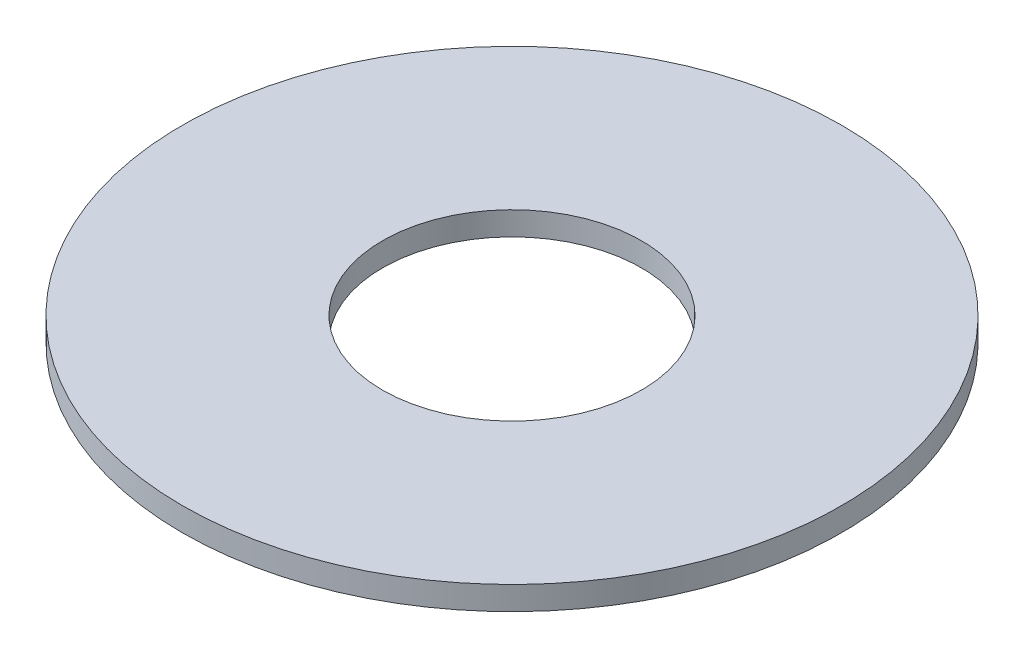
ISO-10303-21;
HEADER;
FILE_DESCRIPTION(('STEP AP214'),'2;1');
FILE_NAME('part.step','',(''),(''),'','','');
FILE_SCHEMA(('AUTOMOTIVE_DESIGN { 1 0 10303 214 1 1 1 1 }'));
ENDSEC;
DATA;
#1=APPLICATION_CONTEXT('core data for automotive mechanical design processes');
#2=APPLICATION_PROTOCOL_DEFINITION('international standard','automotive_design',2000,#1);
#3=PRODUCT_CONTEXT('',#1,'mechanical');
#4=PRODUCT('Part','Part','',(#3));
#5=PRODUCT_RELATED_PRODUCT_CATEGORY('part','',(#4));
#6=PRODUCT_DEFINITION_FORMATION('','',#4);
#7=PRODUCT_DEFINITION_CONTEXT('part definition',#1,'design');
#8=PRODUCT_DEFINITION('design','',#6,#7);
#9=PRODUCT_DEFINITION_SHAPE('','',#8);
#10=(LENGTH_UNIT() NAMED_UNIT(*) SI_UNIT(.MILLI.,.METRE.));
#11=(NAMED_UNIT(*) PLANE_ANGLE_UNIT() SI_UNIT($,.RADIAN.));
#12=(NAMED_UNIT(*) SI_UNIT($,.STERADIAN.) SOLID_ANGLE_UNIT());
#13=UNCERTAINTY_MEASURE_WITH_UNIT(LENGTH_MEASURE(1.E-05),#10,'distance_accuracy_value','');
#14=(GEOMETRIC_REPRESENTATION_CONTEXT(3) GLOBAL_UNCERTAINTY_ASSIGNED_CONTEXT((#13)) GLOBAL_UNIT_ASSIGNED_CONTEXT((#10,
#11,#12)) REPRESENTATION_CONTEXT('',''));
#15=CARTESIAN_POINT('',(0.,0.,0.));
#16=DIRECTION('',(0.,0.,1.));
#17=DIRECTION('',(1.,0.,0.));
#18=AXIS2_PLACEMENT_3D('',#15,#16,#17);
#19=CARTESIAN_POINT('',(0.,5.,0.));
#20=DIRECTION('',(0.,-1.,0.));
#21=DIRECTION('',(0.,0.,-1.));
#22=AXIS2_PLACEMENT_3D('',#19,#20,#21);
#23=CYLINDRICAL_SURFACE('',#22,70.);
#24=CARTESIAN_POINT('',(0.,5.,0.));
#25=DIRECTION('',(0.,1.,0.));
#26=DIRECTION('',(0.,0.,1.));
#27=AXIS2_PLACEMENT_3D('',#24,#25,#26);
#28=CIRCLE('',#27,70.);
#29=CARTESIAN_POINT('',(0.,5.,70.));
#30=VERTEX_POINT('',#29);
#31=EDGE_CURVE('E10',#30,#30,#28,.T.);
#32=ORIENTED_EDGE('',*,*,#31,.F.);
#33=EDGE_LOOP('',(#32));
#34=FACE_BOUND('',#33,.T.);
#35=CARTESIAN_POINT('',(0.,0.,0.));
#36=DIRECTION('',(0.,1.,0.));
#37=DIRECTION('',(0.,0.,1.));
#38=AXIS2_PLACEMENT_3D('',#35,#36,#37);
#39=CIRCLE('',#38,70.);
#40=CARTESIAN_POINT('',(0.,0.,70.));
#41=VERTEX_POINT('',#40);
#42=EDGE_CURVE('E37',#41,#41,#39,.T.);
#43=ORIENTED_EDGE('',*,*,#42,.T.);
#44=EDGE_LOOP('',(#43));
#45=FACE_BOUND('',#44,.T.);
#46=ADVANCED_FACE('F40',(#34,#45),#23,.T.);
#47=CARTESIAN_POINT('',(0.,5.,0.));
#48=DIRECTION('',(0.,1.,0.));
#49=DIRECTION('',(0.,0.,1.));
#50=AXIS2_PLACEMENT_3D('',#47,#48,#49);
#51=PLANE('',#50);
#52=CARTESIAN_POINT('',(0.,5.,0.));
#53=DIRECTION('',(0.,1.,0.));
#54=DIRECTION('',(0.,0.,1.));
#55=AXIS2_PLACEMENT_3D('',#52,#53,#54);
#56=CIRCLE('',#55,27.5);
#57=CARTESIAN_POINT('',(0.,5.,27.5));
#58=VERTEX_POINT('',#57);
#59=EDGE_CURVE('E50',#58,#58,#56,.T.);
#60=ORIENTED_EDGE('',*,*,#59,.F.);
#61=EDGE_LOOP('',(#60));
#62=FACE_BOUND('',#61,.T.);
#63=ORIENTED_EDGE('',*,*,#31,.T.);
#64=EDGE_LOOP('',(#63));
#65=FACE_BOUND('',#64,.T.);
#66=ADVANCED_FACE('F59',(#62,#65),#51,.T.);
#67=CARTESIAN_POINT('',(0.,0.,0.));
#68=DIRECTION('',(0.,1.,0.));
#69=DIRECTION('',(0.,0.,1.));
#70=AXIS2_PLACEMENT_3D('',#67,#68,#69);
#71=PLANE('',#70);
#72=CARTESIAN_POINT('',(0.,0.,0.));
#73=DIRECTION('',(0.,1.,0.));
#74=DIRECTION('',(0.,0.,1.));
#75=AXIS2_PLACEMENT_3D('',#72,#73,#74);
#76=CIRCLE('',#75,27.5);
#77=CARTESIAN_POINT('',(0.,0.,27.5));
#78=VERTEX_POINT('',#77);
#79=EDGE_CURVE('E47',#78,#78,#76,.T.);
#80=ORIENTED_EDGE('',*,*,#79,.T.);
#81=EDGE_LOOP('',(#80));
#82=FACE_BOUND('',#81,.T.);
#83=ORIENTED_EDGE('',*,*,#42,.F.);
#84=EDGE_LOOP('',(#83));
#85=FACE_BOUND('',#84,.T.);
#86=ADVANCED_FACE('F58',(#82,#85),#71,.F.);
#87=CARTESIAN_POINT('',(0.,5.,0.));
#88=DIRECTION('',(0.,-1.,0.));
#89=DIRECTION('',(0.,0.,-1.));
#90=AXIS2_PLACEMENT_3D('',#87,#88,#89);
#91=CYLINDRICAL_SURFACE('',#90,27.5);
#92=ORIENTED_EDGE('',*,*,#59,.T.);
#93=EDGE_LOOP('',(#92));
#94=FACE_BOUND('',#93,.T.);
#95=ORIENTED_EDGE('',*,*,#79,.F.);
#96=EDGE_LOOP('',(#95));
#97=FACE_BOUND('',#96,.T.);
#98=ADVANCED_FACE('F54',(#94,#97),#91,.F.);
#99=CLOSED_SHELL('',(#46,#66,#86,#98));
#100=MANIFOLD_SOLID_BREP('B2',#99);
#101=ADVANCED_BREP_SHAPE_REPRESENTATION('',(#18,#100),#14);
#102=SHAPE_DEFINITION_REPRESENTATION(#9,#101);
ENDSEC;
END-ISO-10303-21;
